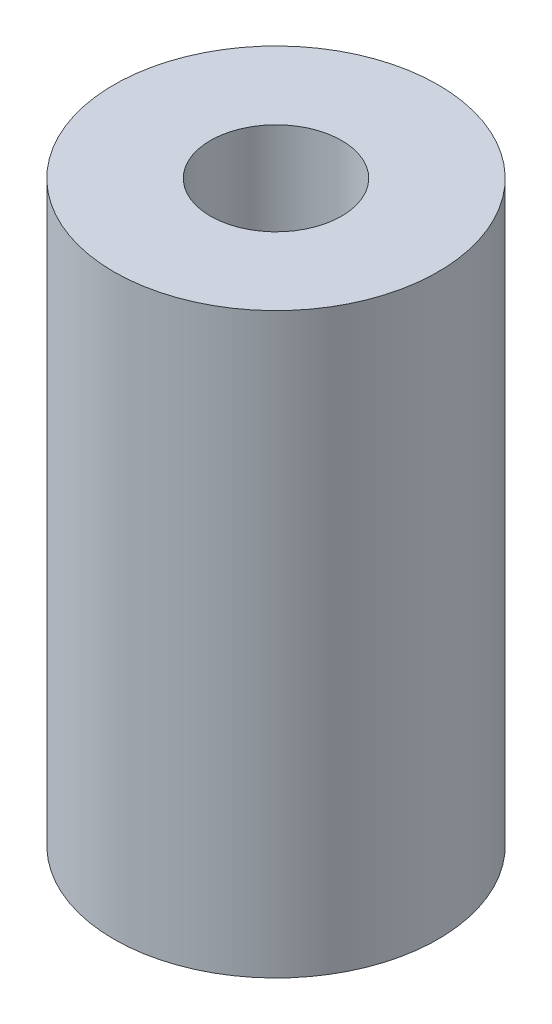
ISO-10303-21;
HEADER;
FILE_DESCRIPTION(('STEP AP214'),'2;1');
FILE_NAME('part.step','',(''),(''),'','','');
FILE_SCHEMA(('AUTOMOTIVE_DESIGN { 1 0 10303 214 1 1 1 1 }'));
ENDSEC;
DATA;
#1=APPLICATION_CONTEXT('core data for automotive mechanical design processes');
#2=APPLICATION_PROTOCOL_DEFINITION('international standard','automotive_design',2000,#1);
#3=PRODUCT_CONTEXT('',#1,'mechanical');
#4=PRODUCT('Part','Part','',(#3));
#5=PRODUCT_RELATED_PRODUCT_CATEGORY('part','',(#4));
#6=PRODUCT_DEFINITION_FORMATION('','',#4);
#7=PRODUCT_DEFINITION_CONTEXT('part definition',#1,'design');
#8=PRODUCT_DEFINITION('design','',#6,#7);
#9=PRODUCT_DEFINITION_SHAPE('','',#8);
#10=(LENGTH_UNIT() NAMED_UNIT(*) SI_UNIT(.MILLI.,.METRE.));
#11=(NAMED_UNIT(*) PLANE_ANGLE_UNIT() SI_UNIT($,.RADIAN.));
#12=(NAMED_UNIT(*) SI_UNIT($,.STERADIAN.) SOLID_ANGLE_UNIT());
#13=UNCERTAINTY_MEASURE_WITH_UNIT(LENGTH_MEASURE(1.E-05),#10,'distance_accuracy_value','');
#14=(GEOMETRIC_REPRESENTATION_CONTEXT(3) GLOBAL_UNCERTAINTY_ASSIGNED_CONTEXT((#13)) GLOBAL_UNIT_ASSIGNED_CONTEXT((#10,
#11,#12)) REPRESENTATION_CONTEXT('',''));
#15=CARTESIAN_POINT('',(0.,0.,0.));
#16=DIRECTION('',(0.,0.,1.));
#17=DIRECTION('',(1.,0.,0.));
#18=AXIS2_PLACEMENT_3D('',#15,#16,#17);
#19=CARTESIAN_POINT('',(0.,152.4,0.));
#20=DIRECTION('',(0.,1.,0.));
#21=DIRECTION('',(0.,0.,1.));
#22=AXIS2_PLACEMENT_3D('',#19,#20,#21);
#23=PLANE('',#22);
#24=CARTESIAN_POINT('',(0.,152.4,0.));
#25=DIRECTION('',(0.,1.,0.));
#26=DIRECTION('',(0.,0.,1.));
#27=AXIS2_PLACEMENT_3D('',#24,#25,#26);
#28=CIRCLE('',#27,42.7355);
#29=CARTESIAN_POINT('',(0.,152.4,42.7355));
#30=VERTEX_POINT('',#29);
#31=EDGE_CURVE('E10',#30,#30,#28,.T.);
#32=ORIENTED_EDGE('',*,*,#31,.T.);
#33=EDGE_LOOP('',(#32));
#34=FACE_BOUND('',#33,.T.);
#35=CARTESIAN_POINT('',(0.,152.4,0.));
#36=DIRECTION('',(0.,1.,0.));
#37=DIRECTION('',(0.,0.,1.));
#38=AXIS2_PLACEMENT_3D('',#35,#36,#37);
#39=CIRCLE('',#38,17.2974);
#40=CARTESIAN_POINT('',(0.,152.4,17.2974));
#41=VERTEX_POINT('',#40);
#42=EDGE_CURVE('E43',#41,#41,#39,.T.);
#43=ORIENTED_EDGE('',*,*,#42,.F.);
#44=EDGE_LOOP('',(#43));
#45=FACE_BOUND('',#44,.T.);
#46=ADVANCED_FACE('F32',(#34,#45),#23,.T.);
#47=CARTESIAN_POINT('',(0.,0.,0.));
#48=DIRECTION('',(0.,1.,0.));
#49=DIRECTION('',(0.,0.,1.));
#50=AXIS2_PLACEMENT_3D('',#47,#48,#49);
#51=PLANE('',#50);
#52=CARTESIAN_POINT('',(0.,0.,0.));
#53=DIRECTION('',(0.,1.,0.));
#54=DIRECTION('',(0.,0.,1.));
#55=AXIS2_PLACEMENT_3D('',#52,#53,#54);
#56=CIRCLE('',#55,42.7355);
#57=CARTESIAN_POINT('',(0.,0.,42.7355));
#58=VERTEX_POINT('',#57);
#59=EDGE_CURVE('E36',#58,#58,#56,.T.);
#60=ORIENTED_EDGE('',*,*,#59,.F.);
#61=EDGE_LOOP('',(#60));
#62=FACE_BOUND('',#61,.T.);
#63=CARTESIAN_POINT('',(0.,0.,0.));
#64=DIRECTION('',(0.,1.,0.));
#65=DIRECTION('',(0.,0.,1.));
#66=AXIS2_PLACEMENT_3D('',#63,#64,#65);
#67=CIRCLE('',#66,17.2974);
#68=CARTESIAN_POINT('',(0.,0.,17.2974));
#69=VERTEX_POINT('',#68);
#70=EDGE_CURVE('E45',#69,#69,#67,.T.);
#71=ORIENTED_EDGE('',*,*,#70,.T.);
#72=EDGE_LOOP('',(#71));
#73=FACE_BOUND('',#72,.T.);
#74=ADVANCED_FACE('F55',(#62,#73),#51,.F.);
#75=CARTESIAN_POINT('',(0.,152.4,0.));
#76=DIRECTION('',(0.,-1.,0.));
#77=DIRECTION('',(0.,0.,-1.));
#78=AXIS2_PLACEMENT_3D('',#75,#76,#77);
#79=CYLINDRICAL_SURFACE('',#78,42.7355);
#80=ORIENTED_EDGE('',*,*,#31,.F.);
#81=EDGE_LOOP('',(#80));
#82=FACE_BOUND('',#81,.T.);
#83=ORIENTED_EDGE('',*,*,#59,.T.);
#84=EDGE_LOOP('',(#83));
#85=FACE_BOUND('',#84,.T.);
#86=ADVANCED_FACE('F34',(#82,#85),#79,.T.);
#87=CARTESIAN_POINT('',(0.,152.4,0.));
#88=DIRECTION('',(0.,-1.,0.));
#89=DIRECTION('',(0.,0.,-1.));
#90=AXIS2_PLACEMENT_3D('',#87,#88,#89);
#91=CYLINDRICAL_SURFACE('',#90,17.2974);
#92=ORIENTED_EDGE('',*,*,#42,.T.);
#93=EDGE_LOOP('',(#92));
#94=FACE_BOUND('',#93,.T.);
#95=ORIENTED_EDGE('',*,*,#70,.F.);
#96=EDGE_LOOP('',(#95));
#97=FACE_BOUND('',#96,.T.);
#98=ADVANCED_FACE('F51',(#94,#97),#91,.F.);
#99=CLOSED_SHELL('',(#46,#74,#86,#98));
#100=MANIFOLD_SOLID_BREP('B2',#99);
#101=ADVANCED_BREP_SHAPE_REPRESENTATION('',(#18,#100),#14);
#102=SHAPE_DEFINITION_REPRESENTATION(#9,#101);
ENDSEC;
END-ISO-10303-21;
